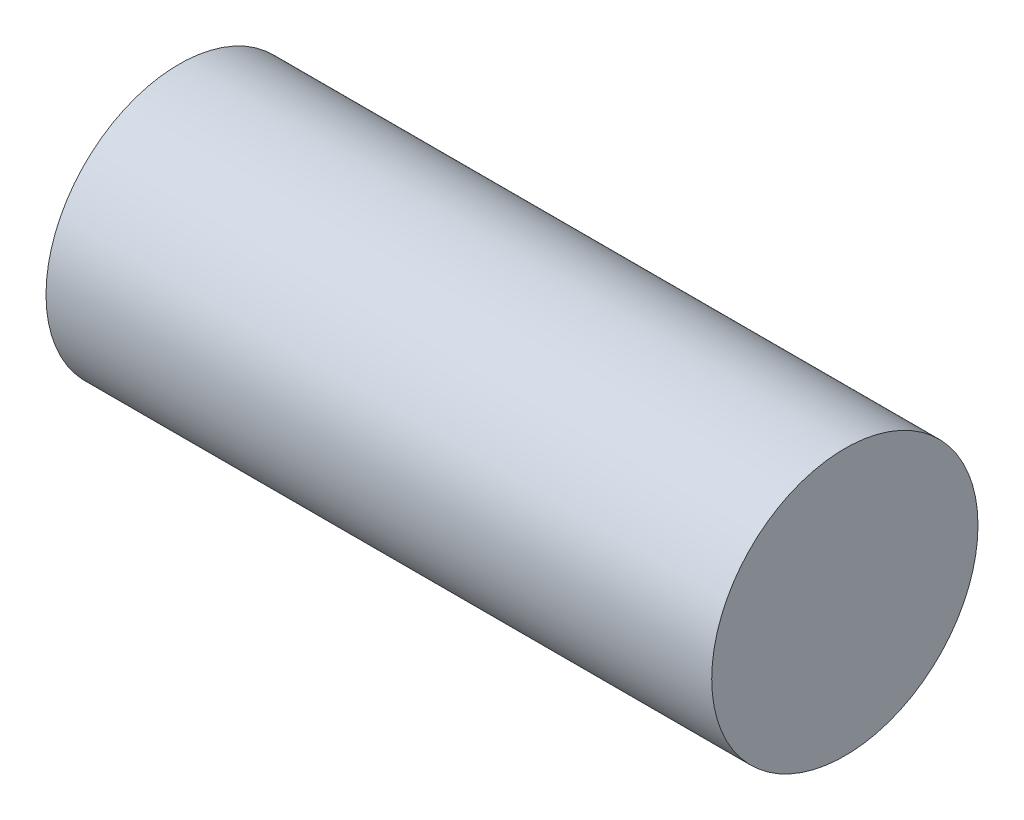
ISO-10303-21;
HEADER;
FILE_DESCRIPTION(('STEP AP214'),'2;1');
FILE_NAME('part.step','',(''),(''),'','','');
FILE_SCHEMA(('AUTOMOTIVE_DESIGN { 1 0 10303 214 1 1 1 1 }'));
ENDSEC;
DATA;
#1=APPLICATION_CONTEXT('core data for automotive mechanical design processes');
#2=APPLICATION_PROTOCOL_DEFINITION('international standard','automotive_design',2000,#1);
#3=PRODUCT_CONTEXT('',#1,'mechanical');
#4=PRODUCT('Part','Part','',(#3));
#5=PRODUCT_RELATED_PRODUCT_CATEGORY('part','',(#4));
#6=PRODUCT_DEFINITION_FORMATION('','',#4);
#7=PRODUCT_DEFINITION_CONTEXT('part definition',#1,'design');
#8=PRODUCT_DEFINITION('design','',#6,#7);
#9=PRODUCT_DEFINITION_SHAPE('','',#8);
#10=(LENGTH_UNIT() NAMED_UNIT(*) SI_UNIT(.MILLI.,.METRE.));
#11=(NAMED_UNIT(*) PLANE_ANGLE_UNIT() SI_UNIT($,.RADIAN.));
#12=(NAMED_UNIT(*) SI_UNIT($,.STERADIAN.) SOLID_ANGLE_UNIT());
#13=UNCERTAINTY_MEASURE_WITH_UNIT(LENGTH_MEASURE(1.E-05),#10,'distance_accuracy_value','');
#14=(GEOMETRIC_REPRESENTATION_CONTEXT(3) GLOBAL_UNCERTAINTY_ASSIGNED_CONTEXT((#13)) GLOBAL_UNIT_ASSIGNED_CONTEXT((#10,
#11,#12)) REPRESENTATION_CONTEXT('',''));
#15=CARTESIAN_POINT('',(0.,0.,0.));
#16=DIRECTION('',(0.,0.,1.));
#17=DIRECTION('',(1.,0.,0.));
#18=AXIS2_PLACEMENT_3D('',#15,#16,#17);
#19=CARTESIAN_POINT('',(0.,0.,0.));
#20=DIRECTION('',(-1.,0.,0.));
#21=DIRECTION('',(0.,0.,1.));
#22=AXIS2_PLACEMENT_3D('',#19,#20,#21);
#23=PLANE('',#22);
#24=CARTESIAN_POINT('',(0.,8.,0.));
#25=DIRECTION('',(-1.,0.,0.));
#26=DIRECTION('',(0.,0.,1.));
#27=AXIS2_PLACEMENT_3D('',#24,#25,#26);
#28=CIRCLE('',#27,8.);
#29=CARTESIAN_POINT('',(0.,8.,8.));
#30=VERTEX_POINT('',#29);
#31=EDGE_CURVE('E41',#30,#30,#28,.T.);
#32=ORIENTED_EDGE('',*,*,#31,.T.);
#33=EDGE_LOOP('',(#32));
#34=FACE_BOUND('',#33,.T.);
#35=ADVANCED_FACE('F35',(#34),#23,.T.);
#36=CARTESIAN_POINT('',(40.,0.,0.));
#37=DIRECTION('',(1.,0.,0.));
#38=DIRECTION('',(0.,0.,-1.));
#39=AXIS2_PLACEMENT_3D('',#36,#37,#38);
#40=PLANE('',#39);
#41=CARTESIAN_POINT('',(40.,8.,0.));
#42=DIRECTION('',(-1.,0.,0.));
#43=DIRECTION('',(0.,0.,1.));
#44=AXIS2_PLACEMENT_3D('',#41,#42,#43);
#45=CIRCLE('',#44,8.);
#46=CARTESIAN_POINT('',(40.,8.,8.));
#47=VERTEX_POINT('',#46);
#48=EDGE_CURVE('E10',#47,#47,#45,.T.);
#49=ORIENTED_EDGE('',*,*,#48,.F.);
#50=EDGE_LOOP('',(#49));
#51=FACE_BOUND('',#50,.T.);
#52=ADVANCED_FACE('F50',(#51),#40,.T.);
#53=CARTESIAN_POINT('',(0.,8.,0.));
#54=DIRECTION('',(-1.,0.,0.));
#55=DIRECTION('',(0.,0.,1.));
#56=AXIS2_PLACEMENT_3D('',#53,#54,#55);
#57=CYLINDRICAL_SURFACE('',#56,8.);
#58=ORIENTED_EDGE('',*,*,#48,.T.);
#59=EDGE_LOOP('',(#58));
#60=FACE_BOUND('',#59,.T.);
#61=ORIENTED_EDGE('',*,*,#31,.F.);
#62=EDGE_LOOP('',(#61));
#63=FACE_BOUND('',#62,.T.);
#64=ADVANCED_FACE('F48',(#60,#63),#57,.T.);
#65=CLOSED_SHELL('',(#35,#52,#64));
#66=MANIFOLD_SOLID_BREP('B2',#65);
#67=ADVANCED_BREP_SHAPE_REPRESENTATION('',(#18,#66),#14);
#68=SHAPE_DEFINITION_REPRESENTATION(#9,#67);
ENDSEC;
END-ISO-10303-21;
